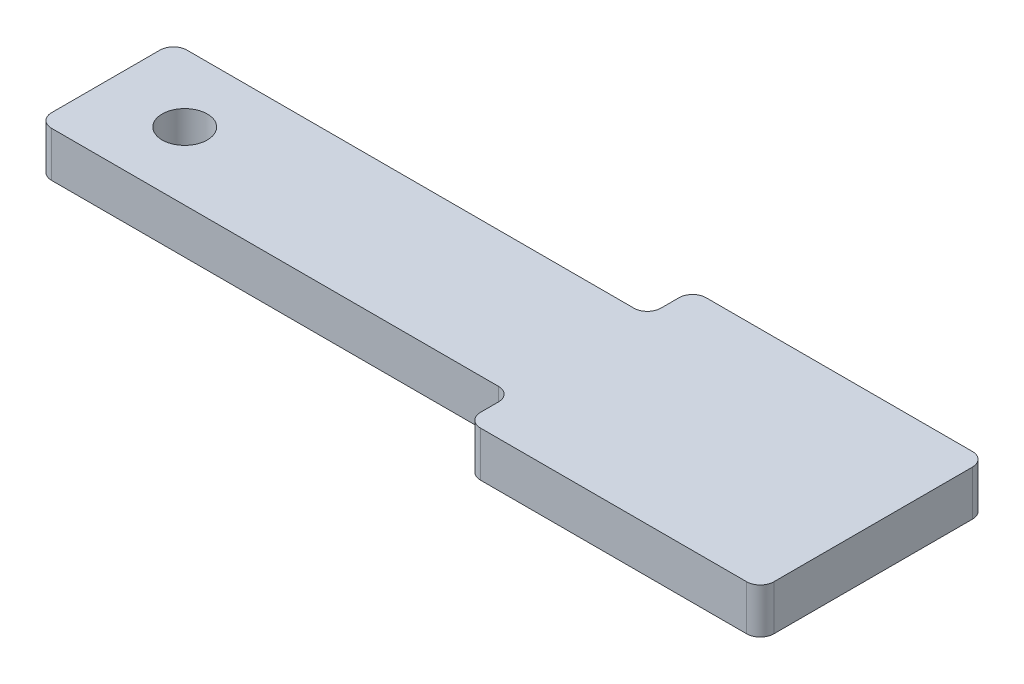
ISO-10303-21;
HEADER;
FILE_DESCRIPTION(('STEP AP214'),'2;1');
FILE_NAME('part.step','',(''),(''),'','','');
FILE_SCHEMA(('AUTOMOTIVE_DESIGN { 1 0 10303 214 1 1 1 1 }'));
ENDSEC;
DATA;
#1=APPLICATION_CONTEXT('core data for automotive mechanical design processes');
#2=APPLICATION_PROTOCOL_DEFINITION('international standard','automotive_design',2000,#1);
#3=PRODUCT_CONTEXT('',#1,'mechanical');
#4=PRODUCT('Part','Part','',(#3));
#5=PRODUCT_RELATED_PRODUCT_CATEGORY('part','',(#4));
#6=PRODUCT_DEFINITION_FORMATION('','',#4);
#7=PRODUCT_DEFINITION_CONTEXT('part definition',#1,'design');
#8=PRODUCT_DEFINITION('design','',#6,#7);
#9=PRODUCT_DEFINITION_SHAPE('','',#8);
#10=(LENGTH_UNIT() NAMED_UNIT(*) SI_UNIT(.MILLI.,.METRE.));
#11=(NAMED_UNIT(*) PLANE_ANGLE_UNIT() SI_UNIT($,.RADIAN.));
#12=(NAMED_UNIT(*) SI_UNIT($,.STERADIAN.) SOLID_ANGLE_UNIT());
#13=UNCERTAINTY_MEASURE_WITH_UNIT(LENGTH_MEASURE(1.E-05),#10,'distance_accuracy_value','');
#14=(GEOMETRIC_REPRESENTATION_CONTEXT(3) GLOBAL_UNCERTAINTY_ASSIGNED_CONTEXT((#13)) GLOBAL_UNIT_ASSIGNED_CONTEXT((#10,
#11,#12)) REPRESENTATION_CONTEXT('',''));
#15=CARTESIAN_POINT('',(0.,0.,0.));
#16=DIRECTION('',(0.,0.,1.));
#17=DIRECTION('',(1.,0.,0.));
#18=AXIS2_PLACEMENT_3D('',#15,#16,#17);
#19=CARTESIAN_POINT('',(0.,1.,0.));
#20=DIRECTION('',(0.,1.,0.));
#21=DIRECTION('',(0.,0.,1.));
#22=AXIS2_PLACEMENT_3D('',#19,#20,#21);
#23=PLANE('',#22);
#24=DIRECTION('',(-1.,0.,0.));
#25=VECTOR('',#24,1.);
#26=CARTESIAN_POINT('',(-4.5,1.,-3.));
#27=LINE('',#26,#25);
#28=CARTESIAN_POINT('',(-4.8,1.,-3.));
#29=VERTEX_POINT('',#28);
#30=CARTESIAN_POINT('',(-14.7,1.,-3.));
#31=VERTEX_POINT('',#30);
#32=EDGE_CURVE('E184',#29,#31,#27,.T.);
#33=ORIENTED_EDGE('',*,*,#32,.T.);
#34=CARTESIAN_POINT('',(-14.7,1.,-2.7));
#35=DIRECTION('',(0.,1.,0.));
#36=DIRECTION('',(0.,0.,1.));
#37=AXIS2_PLACEMENT_3D('',#34,#35,#36);
#38=CIRCLE('',#37,0.3);
#39=CARTESIAN_POINT('',(-15.,1.,-2.7));
#40=VERTEX_POINT('',#39);
#41=EDGE_CURVE('E223',#31,#40,#38,.T.);
#42=ORIENTED_EDGE('',*,*,#41,.T.);
#43=DIRECTION('',(0.,0.,1.));
#44=VECTOR('',#43,1.);
#45=CARTESIAN_POINT('',(-15.,1.,0.));
#46=LINE('',#45,#44);
#47=CARTESIAN_POINT('',(-15.,1.,-0.299999999999998));
#48=VERTEX_POINT('',#47);
#49=EDGE_CURVE('E167',#40,#48,#46,.T.);
#50=ORIENTED_EDGE('',*,*,#49,.T.);
#51=CARTESIAN_POINT('',(-14.7,1.,-0.299999999999998));
#52=DIRECTION('',(0.,1.,0.));
#53=DIRECTION('',(0.,0.,1.));
#54=AXIS2_PLACEMENT_3D('',#51,#52,#53);
#55=CIRCLE('',#54,0.3);
#56=CARTESIAN_POINT('',(-14.7,1.,0.));
#57=VERTEX_POINT('',#56);
#58=EDGE_CURVE('E214',#48,#57,#55,.T.);
#59=ORIENTED_EDGE('',*,*,#58,.T.);
#60=DIRECTION('',(1.,0.,0.));
#61=VECTOR('',#60,1.);
#62=CARTESIAN_POINT('',(-4.5,1.,0.));
#63=LINE('',#62,#61);
#64=CARTESIAN_POINT('',(-4.8,1.,0.));
#65=VERTEX_POINT('',#64);
#66=EDGE_CURVE('E274',#57,#65,#63,.T.);
#67=ORIENTED_EDGE('',*,*,#66,.T.);
#68=CARTESIAN_POINT('',(-4.8,1.,0.300000000000001));
#69=DIRECTION('',(0.,1.,0.));
#70=DIRECTION('',(0.,0.,1.));
#71=AXIS2_PLACEMENT_3D('',#68,#69,#70);
#72=CIRCLE('',#71,0.3);
#73=CARTESIAN_POINT('',(-4.5,1.,0.300000000000001));
#74=VERTEX_POINT('',#73);
#75=EDGE_CURVE('E11',#65,#74,#72,.F.);
#76=ORIENTED_EDGE('',*,*,#75,.T.);
#77=DIRECTION('',(0.,0.,1.));
#78=VECTOR('',#77,1.);
#79=CARTESIAN_POINT('',(-4.5,1.,0.));
#80=LINE('',#79,#78);
#81=CARTESIAN_POINT('',(-4.5,1.,0.700000000000001));
#82=VERTEX_POINT('',#81);
#83=EDGE_CURVE('E272',#74,#82,#80,.T.);
#84=ORIENTED_EDGE('',*,*,#83,.T.);
#85=CARTESIAN_POINT('',(-4.2,1.,0.700000000000001));
#86=DIRECTION('',(0.,1.,0.));
#87=DIRECTION('',(0.,0.,1.));
#88=AXIS2_PLACEMENT_3D('',#85,#86,#87);
#89=CIRCLE('',#88,0.3);
#90=CARTESIAN_POINT('',(-4.2,1.,1.));
#91=VERTEX_POINT('',#90);
#92=EDGE_CURVE('E216',#82,#91,#89,.T.);
#93=ORIENTED_EDGE('',*,*,#92,.T.);
#94=DIRECTION('',(1.,0.,0.));
#95=VECTOR('',#94,1.);
#96=CARTESIAN_POINT('',(-4.5,1.,1.));
#97=LINE('',#96,#95);
#98=CARTESIAN_POINT('',(1.7,1.,1.));
#99=VERTEX_POINT('',#98);
#100=EDGE_CURVE('E278',#91,#99,#97,.T.);
#101=ORIENTED_EDGE('',*,*,#100,.T.);
#102=CARTESIAN_POINT('',(1.7,1.,0.7));
#103=DIRECTION('',(0.,1.,0.));
#104=DIRECTION('',(0.,0.,1.));
#105=AXIS2_PLACEMENT_3D('',#102,#103,#104);
#106=CIRCLE('',#105,0.3);
#107=CARTESIAN_POINT('',(2.,1.,0.7));
#108=VERTEX_POINT('',#107);
#109=EDGE_CURVE('E218',#99,#108,#106,.T.);
#110=ORIENTED_EDGE('',*,*,#109,.T.);
#111=DIRECTION('',(0.,0.,-1.));
#112=VECTOR('',#111,1.);
#113=CARTESIAN_POINT('',(2.,1.,1.));
#114=LINE('',#113,#112);
#115=CARTESIAN_POINT('',(2.,1.,-3.7));
#116=VERTEX_POINT('',#115);
#117=EDGE_CURVE('E281',#108,#116,#114,.T.);
#118=ORIENTED_EDGE('',*,*,#117,.T.);
#119=CARTESIAN_POINT('',(1.7,1.,-3.7));
#120=DIRECTION('',(0.,1.,0.));
#121=DIRECTION('',(0.,0.,1.));
#122=AXIS2_PLACEMENT_3D('',#119,#120,#121);
#123=CIRCLE('',#122,0.3);
#124=CARTESIAN_POINT('',(1.7,1.,-4.));
#125=VERTEX_POINT('',#124);
#126=EDGE_CURVE('E220',#116,#125,#123,.T.);
#127=ORIENTED_EDGE('',*,*,#126,.T.);
#128=DIRECTION('',(-1.,0.,0.));
#129=VECTOR('',#128,1.);
#130=CARTESIAN_POINT('',(-4.5,1.,-4.));
#131=LINE('',#130,#129);
#132=CARTESIAN_POINT('',(-4.2,1.,-4.));
#133=VERTEX_POINT('',#132);
#134=EDGE_CURVE('E288',#125,#133,#131,.T.);
#135=ORIENTED_EDGE('',*,*,#134,.T.);
#136=CARTESIAN_POINT('',(-4.2,1.,-3.7));
#137=DIRECTION('',(0.,1.,0.));
#138=DIRECTION('',(0.,0.,1.));
#139=AXIS2_PLACEMENT_3D('',#136,#137,#138);
#140=CIRCLE('',#139,0.3);
#141=CARTESIAN_POINT('',(-4.5,1.,-3.7));
#142=VERTEX_POINT('',#141);
#143=EDGE_CURVE('E55',#133,#142,#140,.T.);
#144=ORIENTED_EDGE('',*,*,#143,.T.);
#145=DIRECTION('',(0.,0.,1.));
#146=VECTOR('',#145,1.);
#147=CARTESIAN_POINT('',(-4.5,1.,-3.));
#148=LINE('',#147,#146);
#149=CARTESIAN_POINT('',(-4.5,1.,-3.3));
#150=VERTEX_POINT('',#149);
#151=EDGE_CURVE('E289',#142,#150,#148,.T.);
#152=ORIENTED_EDGE('',*,*,#151,.T.);
#153=CARTESIAN_POINT('',(-4.8,1.,-3.3));
#154=DIRECTION('',(0.,1.,0.));
#155=DIRECTION('',(0.,0.,1.));
#156=AXIS2_PLACEMENT_3D('',#153,#154,#155);
#157=CIRCLE('',#156,0.3);
#158=EDGE_CURVE('E256',#150,#29,#157,.F.);
#159=ORIENTED_EDGE('',*,*,#158,.T.);
#160=EDGE_LOOP('',(#33,#42,#50,#59,#67,#76,#84,#93,#101,#110,#118,#127,#135,#144,#152,#159));
#161=FACE_BOUND('',#160,.T.);
#162=CARTESIAN_POINT('',(-13.25,1.,-1.5));
#163=DIRECTION('',(0.,1.,0.));
#164=DIRECTION('',(0.,0.,1.));
#165=AXIS2_PLACEMENT_3D('',#162,#163,#164);
#166=CIRCLE('',#165,0.500000000000001);
#167=CARTESIAN_POINT('',(-13.25,1.,-0.999999999999998));
#168=VERTEX_POINT('',#167);
#169=EDGE_CURVE('E175',#168,#168,#166,.T.);
#170=ORIENTED_EDGE('',*,*,#169,.F.);
#171=EDGE_LOOP('',(#170));
#172=FACE_BOUND('',#171,.T.);
#173=ADVANCED_FACE('F33',(#161,#172),#23,.T.);
#174=CARTESIAN_POINT('',(0.,0.,0.));
#175=DIRECTION('',(0.,1.,0.));
#176=DIRECTION('',(0.,0.,1.));
#177=AXIS2_PLACEMENT_3D('',#174,#175,#176);
#178=PLANE('',#177);
#179=DIRECTION('',(0.,0.,1.));
#180=VECTOR('',#179,1.);
#181=CARTESIAN_POINT('',(-15.,0.,0.));
#182=LINE('',#181,#180);
#183=CARTESIAN_POINT('',(-15.,0.,-2.7));
#184=VERTEX_POINT('',#183);
#185=CARTESIAN_POINT('',(-15.,0.,-0.299999999999998));
#186=VERTEX_POINT('',#185);
#187=EDGE_CURVE('E164',#184,#186,#182,.T.);
#188=ORIENTED_EDGE('',*,*,#187,.F.);
#189=CARTESIAN_POINT('',(-14.7,0.,-2.7));
#190=DIRECTION('',(0.,1.,0.));
#191=DIRECTION('',(0.,0.,1.));
#192=AXIS2_PLACEMENT_3D('',#189,#190,#191);
#193=CIRCLE('',#192,0.3);
#194=CARTESIAN_POINT('',(-14.7,0.,-3.));
#195=VERTEX_POINT('',#194);
#196=EDGE_CURVE('E147',#184,#195,#193,.F.);
#197=ORIENTED_EDGE('',*,*,#196,.T.);
#198=DIRECTION('',(-1.,0.,0.));
#199=VECTOR('',#198,1.);
#200=CARTESIAN_POINT('',(-4.5,0.,-3.));
#201=LINE('',#200,#199);
#202=CARTESIAN_POINT('',(-4.8,0.,-3.));
#203=VERTEX_POINT('',#202);
#204=EDGE_CURVE('E200',#203,#195,#201,.T.);
#205=ORIENTED_EDGE('',*,*,#204,.F.);
#206=CARTESIAN_POINT('',(-4.8,0.,-3.3));
#207=DIRECTION('',(0.,1.,0.));
#208=DIRECTION('',(0.,0.,1.));
#209=AXIS2_PLACEMENT_3D('',#206,#207,#208);
#210=CIRCLE('',#209,0.3);
#211=CARTESIAN_POINT('',(-4.5,0.,-3.3));
#212=VERTEX_POINT('',#211);
#213=EDGE_CURVE('E254',#203,#212,#210,.T.);
#214=ORIENTED_EDGE('',*,*,#213,.T.);
#215=DIRECTION('',(0.,0.,1.));
#216=VECTOR('',#215,1.);
#217=CARTESIAN_POINT('',(-4.5,0.,-3.));
#218=LINE('',#217,#216);
#219=CARTESIAN_POINT('',(-4.5,0.,-3.7));
#220=VERTEX_POINT('',#219);
#221=EDGE_CURVE('E198',#220,#212,#218,.T.);
#222=ORIENTED_EDGE('',*,*,#221,.F.);
#223=CARTESIAN_POINT('',(-4.2,0.,-3.7));
#224=DIRECTION('',(0.,1.,0.));
#225=DIRECTION('',(0.,0.,1.));
#226=AXIS2_PLACEMENT_3D('',#223,#224,#225);
#227=CIRCLE('',#226,0.3);
#228=CARTESIAN_POINT('',(-4.2,0.,-4.));
#229=VERTEX_POINT('',#228);
#230=EDGE_CURVE('E158',#220,#229,#227,.F.);
#231=ORIENTED_EDGE('',*,*,#230,.T.);
#232=DIRECTION('',(-1.,0.,0.));
#233=VECTOR('',#232,1.);
#234=CARTESIAN_POINT('',(-4.5,0.,-4.));
#235=LINE('',#234,#233);
#236=CARTESIAN_POINT('',(1.7,0.,-4.));
#237=VERTEX_POINT('',#236);
#238=EDGE_CURVE('E195',#237,#229,#235,.T.);
#239=ORIENTED_EDGE('',*,*,#238,.F.);
#240=CARTESIAN_POINT('',(1.7,0.,-3.7));
#241=DIRECTION('',(0.,1.,0.));
#242=DIRECTION('',(0.,0.,1.));
#243=AXIS2_PLACEMENT_3D('',#240,#241,#242);
#244=CIRCLE('',#243,0.3);
#245=CARTESIAN_POINT('',(2.,0.,-3.7));
#246=VERTEX_POINT('',#245);
#247=EDGE_CURVE('E208',#237,#246,#244,.F.);
#248=ORIENTED_EDGE('',*,*,#247,.T.);
#249=DIRECTION('',(0.,0.,-1.));
#250=VECTOR('',#249,1.);
#251=CARTESIAN_POINT('',(2.,0.,1.));
#252=LINE('',#251,#250);
#253=CARTESIAN_POINT('',(2.,0.,0.7));
#254=VERTEX_POINT('',#253);
#255=EDGE_CURVE('E192',#254,#246,#252,.T.);
#256=ORIENTED_EDGE('',*,*,#255,.F.);
#257=CARTESIAN_POINT('',(1.7,0.,0.7));
#258=DIRECTION('',(0.,1.,0.));
#259=DIRECTION('',(0.,0.,1.));
#260=AXIS2_PLACEMENT_3D('',#257,#258,#259);
#261=CIRCLE('',#260,0.3);
#262=CARTESIAN_POINT('',(1.7,0.,1.));
#263=VERTEX_POINT('',#262);
#264=EDGE_CURVE('E206',#254,#263,#261,.F.);
#265=ORIENTED_EDGE('',*,*,#264,.T.);
#266=DIRECTION('',(1.,0.,0.));
#267=VECTOR('',#266,1.);
#268=CARTESIAN_POINT('',(-4.5,0.,1.));
#269=LINE('',#268,#267);
#270=CARTESIAN_POINT('',(-4.2,0.,1.));
#271=VERTEX_POINT('',#270);
#272=EDGE_CURVE('E189',#271,#263,#269,.T.);
#273=ORIENTED_EDGE('',*,*,#272,.F.);
#274=CARTESIAN_POINT('',(-4.2,0.,0.700000000000001));
#275=DIRECTION('',(0.,1.,0.));
#276=DIRECTION('',(0.,0.,1.));
#277=AXIS2_PLACEMENT_3D('',#274,#275,#276);
#278=CIRCLE('',#277,0.3);
#279=CARTESIAN_POINT('',(-4.5,0.,0.700000000000001));
#280=VERTEX_POINT('',#279);
#281=EDGE_CURVE('E204',#271,#280,#278,.F.);
#282=ORIENTED_EDGE('',*,*,#281,.T.);
#283=DIRECTION('',(0.,0.,1.));
#284=VECTOR('',#283,1.);
#285=CARTESIAN_POINT('',(-4.5,0.,0.));
#286=LINE('',#285,#284);
#287=CARTESIAN_POINT('',(-4.5,0.,0.300000000000001));
#288=VERTEX_POINT('',#287);
#289=EDGE_CURVE('E178',#288,#280,#286,.T.);
#290=ORIENTED_EDGE('',*,*,#289,.F.);
#291=CARTESIAN_POINT('',(-4.8,0.,0.300000000000001));
#292=DIRECTION('',(0.,1.,0.));
#293=DIRECTION('',(0.,0.,1.));
#294=AXIS2_PLACEMENT_3D('',#291,#292,#293);
#295=CIRCLE('',#294,0.3);
#296=CARTESIAN_POINT('',(-4.8,0.,0.));
#297=VERTEX_POINT('',#296);
#298=EDGE_CURVE('E41',#288,#297,#295,.T.);
#299=ORIENTED_EDGE('',*,*,#298,.T.);
#300=DIRECTION('',(1.,0.,0.));
#301=VECTOR('',#300,1.);
#302=CARTESIAN_POINT('',(-4.5,0.,0.));
#303=LINE('',#302,#301);
#304=CARTESIAN_POINT('',(-14.7,0.,0.));
#305=VERTEX_POINT('',#304);
#306=EDGE_CURVE('E174',#305,#297,#303,.T.);
#307=ORIENTED_EDGE('',*,*,#306,.F.);
#308=CARTESIAN_POINT('',(-14.7,0.,-0.299999999999998));
#309=DIRECTION('',(0.,1.,0.));
#310=DIRECTION('',(0.,0.,1.));
#311=AXIS2_PLACEMENT_3D('',#308,#309,#310);
#312=CIRCLE('',#311,0.3);
#313=EDGE_CURVE('E168',#305,#186,#312,.F.);
#314=ORIENTED_EDGE('',*,*,#313,.T.);
#315=EDGE_LOOP('',(#188,#197,#205,#214,#222,#231,#239,#248,#256,#265,#273,#282,#290,#299,#307,#314));
#316=FACE_BOUND('',#315,.T.);
#317=CARTESIAN_POINT('',(-13.25,0.,-1.5));
#318=DIRECTION('',(0.,1.,0.));
#319=DIRECTION('',(0.,0.,1.));
#320=AXIS2_PLACEMENT_3D('',#317,#318,#319);
#321=CIRCLE('',#320,0.500000000000001);
#322=CARTESIAN_POINT('',(-13.25,0.,-0.999999999999998));
#323=VERTEX_POINT('',#322);
#324=EDGE_CURVE('E181',#323,#323,#321,.T.);
#325=ORIENTED_EDGE('',*,*,#324,.T.);
#326=EDGE_LOOP('',(#325));
#327=FACE_BOUND('',#326,.T.);
#328=ADVANCED_FACE('F171',(#316,#327),#178,.F.);
#329=CARTESIAN_POINT('',(-15.,1.,0.));
#330=DIRECTION('',(1.,0.,0.));
#331=DIRECTION('',(0.,0.,-1.));
#332=AXIS2_PLACEMENT_3D('',#329,#330,#331);
#333=PLANE('',#332);
#334=ORIENTED_EDGE('',*,*,#49,.F.);
#335=DIRECTION('',(0.,-1.,0.));
#336=VECTOR('',#335,1.);
#337=CARTESIAN_POINT('',(-15.,1.,-2.7));
#338=LINE('',#337,#336);
#339=EDGE_CURVE('E151',#40,#184,#338,.T.);
#340=ORIENTED_EDGE('',*,*,#339,.T.);
#341=ORIENTED_EDGE('',*,*,#187,.T.);
#342=DIRECTION('',(0.,-1.,0.));
#343=VECTOR('',#342,1.);
#344=CARTESIAN_POINT('',(-15.,1.,-0.299999999999998));
#345=LINE('',#344,#343);
#346=EDGE_CURVE('E169',#186,#48,#345,.F.);
#347=ORIENTED_EDGE('',*,*,#346,.T.);
#348=EDGE_LOOP('',(#334,#340,#341,#347));
#349=FACE_BOUND('',#348,.T.);
#350=ADVANCED_FACE('F163',(#349),#333,.F.);
#351=CARTESIAN_POINT('',(-4.5,1.,0.));
#352=DIRECTION('',(0.,0.,-1.));
#353=DIRECTION('',(-1.,0.,0.));
#354=AXIS2_PLACEMENT_3D('',#351,#352,#353);
#355=PLANE('',#354);
#356=ORIENTED_EDGE('',*,*,#306,.T.);
#357=DIRECTION('',(0.,-1.,0.));
#358=VECTOR('',#357,1.);
#359=CARTESIAN_POINT('',(-4.8,1.,0.));
#360=LINE('',#359,#358);
#361=EDGE_CURVE('E252',#297,#65,#360,.F.);
#362=ORIENTED_EDGE('',*,*,#361,.T.);
#363=ORIENTED_EDGE('',*,*,#66,.F.);
#364=DIRECTION('',(0.,-1.,0.));
#365=VECTOR('',#364,1.);
#366=CARTESIAN_POINT('',(-14.7,1.,0.));
#367=LINE('',#366,#365);
#368=EDGE_CURVE('E249',#57,#305,#367,.T.);
#369=ORIENTED_EDGE('',*,*,#368,.T.);
#370=EDGE_LOOP('',(#356,#362,#363,#369));
#371=FACE_BOUND('',#370,.T.);
#372=ADVANCED_FACE('F262',(#371),#355,.F.);
#373=CARTESIAN_POINT('',(-4.5,1.,0.));
#374=DIRECTION('',(1.,0.,0.));
#375=DIRECTION('',(0.,0.,-1.));
#376=AXIS2_PLACEMENT_3D('',#373,#374,#375);
#377=PLANE('',#376);
#378=ORIENTED_EDGE('',*,*,#289,.T.);
#379=DIRECTION('',(0.,-1.,0.));
#380=VECTOR('',#379,1.);
#381=CARTESIAN_POINT('',(-4.5,1.,0.700000000000001));
#382=LINE('',#381,#380);
#383=EDGE_CURVE('E247',#280,#82,#382,.F.);
#384=ORIENTED_EDGE('',*,*,#383,.T.);
#385=ORIENTED_EDGE('',*,*,#83,.F.);
#386=DIRECTION('',(0.,-1.,0.));
#387=VECTOR('',#386,1.);
#388=CARTESIAN_POINT('',(-4.5,0.,0.300000000000001));
#389=LINE('',#388,#387);
#390=EDGE_CURVE('E244',#74,#288,#389,.T.);
#391=ORIENTED_EDGE('',*,*,#390,.T.);
#392=EDGE_LOOP('',(#378,#384,#385,#391));
#393=FACE_BOUND('',#392,.T.);
#394=ADVANCED_FACE('F276',(#393),#377,.F.);
#395=CARTESIAN_POINT('',(-4.5,1.,1.));
#396=DIRECTION('',(0.,0.,-1.));
#397=DIRECTION('',(-1.,0.,0.));
#398=AXIS2_PLACEMENT_3D('',#395,#396,#397);
#399=PLANE('',#398);
#400=ORIENTED_EDGE('',*,*,#272,.T.);
#401=DIRECTION('',(0.,-1.,0.));
#402=VECTOR('',#401,1.);
#403=CARTESIAN_POINT('',(1.7,1.,1.));
#404=LINE('',#403,#402);
#405=EDGE_CURVE('E242',#263,#99,#404,.F.);
#406=ORIENTED_EDGE('',*,*,#405,.T.);
#407=ORIENTED_EDGE('',*,*,#100,.F.);
#408=DIRECTION('',(0.,-1.,0.));
#409=VECTOR('',#408,1.);
#410=CARTESIAN_POINT('',(-4.2,1.,1.));
#411=LINE('',#410,#409);
#412=EDGE_CURVE('E239',#91,#271,#411,.T.);
#413=ORIENTED_EDGE('',*,*,#412,.T.);
#414=EDGE_LOOP('',(#400,#406,#407,#413));
#415=FACE_BOUND('',#414,.T.);
#416=ADVANCED_FACE('F323',(#415),#399,.F.);
#417=CARTESIAN_POINT('',(2.,1.,1.));
#418=DIRECTION('',(-1.,0.,0.));
#419=DIRECTION('',(0.,0.,1.));
#420=AXIS2_PLACEMENT_3D('',#417,#418,#419);
#421=PLANE('',#420);
#422=ORIENTED_EDGE('',*,*,#255,.T.);
#423=DIRECTION('',(0.,-1.,0.));
#424=VECTOR('',#423,1.);
#425=CARTESIAN_POINT('',(2.,1.,-3.7));
#426=LINE('',#425,#424);
#427=EDGE_CURVE('E237',#246,#116,#426,.F.);
#428=ORIENTED_EDGE('',*,*,#427,.T.);
#429=ORIENTED_EDGE('',*,*,#117,.F.);
#430=DIRECTION('',(0.,-1.,0.));
#431=VECTOR('',#430,1.);
#432=CARTESIAN_POINT('',(2.,1.,0.7));
#433=LINE('',#432,#431);
#434=EDGE_CURVE('E234',#108,#254,#433,.T.);
#435=ORIENTED_EDGE('',*,*,#434,.T.);
#436=EDGE_LOOP('',(#422,#428,#429,#435));
#437=FACE_BOUND('',#436,.T.);
#438=ADVANCED_FACE('F314',(#437),#421,.F.);
#439=CARTESIAN_POINT('',(-4.5,1.,-4.));
#440=DIRECTION('',(0.,0.,1.));
#441=DIRECTION('',(1.,0.,0.));
#442=AXIS2_PLACEMENT_3D('',#439,#440,#441);
#443=PLANE('',#442);
#444=ORIENTED_EDGE('',*,*,#238,.T.);
#445=DIRECTION('',(0.,-1.,0.));
#446=VECTOR('',#445,1.);
#447=CARTESIAN_POINT('',(-4.2,1.,-4.));
#448=LINE('',#447,#446);
#449=EDGE_CURVE('E232',#229,#133,#448,.F.);
#450=ORIENTED_EDGE('',*,*,#449,.T.);
#451=ORIENTED_EDGE('',*,*,#134,.F.);
#452=DIRECTION('',(0.,-1.,0.));
#453=VECTOR('',#452,1.);
#454=CARTESIAN_POINT('',(1.7,1.,-4.));
#455=LINE('',#454,#453);
#456=EDGE_CURVE('E229',#125,#237,#455,.T.);
#457=ORIENTED_EDGE('',*,*,#456,.T.);
#458=EDGE_LOOP('',(#444,#450,#451,#457));
#459=FACE_BOUND('',#458,.T.);
#460=ADVANCED_FACE('F305',(#459),#443,.F.);
#461=CARTESIAN_POINT('',(-4.5,1.,-3.));
#462=DIRECTION('',(1.,0.,0.));
#463=DIRECTION('',(0.,0.,-1.));
#464=AXIS2_PLACEMENT_3D('',#461,#462,#463);
#465=PLANE('',#464);
#466=ORIENTED_EDGE('',*,*,#221,.T.);
#467=DIRECTION('',(0.,-1.,0.));
#468=VECTOR('',#467,1.);
#469=CARTESIAN_POINT('',(-4.5,1.,-3.3));
#470=LINE('',#469,#468);
#471=EDGE_CURVE('E48',#212,#150,#470,.F.);
#472=ORIENTED_EDGE('',*,*,#471,.T.);
#473=ORIENTED_EDGE('',*,*,#151,.F.);
#474=DIRECTION('',(0.,-1.,0.));
#475=VECTOR('',#474,1.);
#476=CARTESIAN_POINT('',(-4.5,1.,-3.7));
#477=LINE('',#476,#475);
#478=EDGE_CURVE('E225',#142,#220,#477,.T.);
#479=ORIENTED_EDGE('',*,*,#478,.T.);
#480=EDGE_LOOP('',(#466,#472,#473,#479));
#481=FACE_BOUND('',#480,.T.);
#482=ADVANCED_FACE('F298',(#481),#465,.F.);
#483=CARTESIAN_POINT('',(-4.5,1.,-3.));
#484=DIRECTION('',(0.,0.,1.));
#485=DIRECTION('',(1.,0.,0.));
#486=AXIS2_PLACEMENT_3D('',#483,#484,#485);
#487=PLANE('',#486);
#488=ORIENTED_EDGE('',*,*,#204,.T.);
#489=DIRECTION('',(0.,-1.,0.));
#490=VECTOR('',#489,1.);
#491=CARTESIAN_POINT('',(-14.7,1.,-3.));
#492=LINE('',#491,#490);
#493=EDGE_CURVE('E152',#195,#31,#492,.F.);
#494=ORIENTED_EDGE('',*,*,#493,.T.);
#495=ORIENTED_EDGE('',*,*,#32,.F.);
#496=DIRECTION('',(0.,-1.,0.));
#497=VECTOR('',#496,1.);
#498=CARTESIAN_POINT('',(-4.8,0.,-3.));
#499=LINE('',#498,#497);
#500=EDGE_CURVE('E157',#29,#203,#499,.T.);
#501=ORIENTED_EDGE('',*,*,#500,.T.);
#502=EDGE_LOOP('',(#488,#494,#495,#501));
#503=FACE_BOUND('',#502,.T.);
#504=ADVANCED_FACE('F294',(#503),#487,.F.);
#505=CARTESIAN_POINT('',(-13.25,1.,-1.5));
#506=DIRECTION('',(0.,-1.,0.));
#507=DIRECTION('',(0.,0.,-1.));
#508=AXIS2_PLACEMENT_3D('',#505,#506,#507);
#509=CYLINDRICAL_SURFACE('',#508,0.500000000000001);
#510=ORIENTED_EDGE('',*,*,#169,.T.);
#511=EDGE_LOOP('',(#510));
#512=FACE_BOUND('',#511,.T.);
#513=ORIENTED_EDGE('',*,*,#324,.F.);
#514=EDGE_LOOP('',(#513));
#515=FACE_BOUND('',#514,.T.);
#516=ADVANCED_FACE('F342',(#512,#515),#509,.F.);
#517=CARTESIAN_POINT('',(-14.7,1.,-2.7));
#518=DIRECTION('',(0.,-1.,0.));
#519=DIRECTION('',(0.,0.,-1.));
#520=AXIS2_PLACEMENT_3D('',#517,#518,#519);
#521=CYLINDRICAL_SURFACE('',#520,0.3);
#522=ORIENTED_EDGE('',*,*,#41,.F.);
#523=ORIENTED_EDGE('',*,*,#493,.F.);
#524=ORIENTED_EDGE('',*,*,#196,.F.);
#525=ORIENTED_EDGE('',*,*,#339,.F.);
#526=EDGE_LOOP('',(#522,#523,#524,#525));
#527=FACE_BOUND('',#526,.T.);
#528=ADVANCED_FACE('F150',(#527),#521,.T.);
#529=CARTESIAN_POINT('',(-4.8,1.,-3.3));
#530=DIRECTION('',(0.,1.,0.));
#531=DIRECTION('',(0.,0.,1.));
#532=AXIS2_PLACEMENT_3D('',#529,#530,#531);
#533=CYLINDRICAL_SURFACE('',#532,0.3);
#534=ORIENTED_EDGE('',*,*,#158,.F.);
#535=ORIENTED_EDGE('',*,*,#471,.F.);
#536=ORIENTED_EDGE('',*,*,#213,.F.);
#537=ORIENTED_EDGE('',*,*,#500,.F.);
#538=EDGE_LOOP('',(#534,#535,#536,#537));
#539=FACE_BOUND('',#538,.T.);
#540=ADVANCED_FACE('F296',(#539),#533,.F.);
#541=CARTESIAN_POINT('',(-4.2,1.,-3.7));
#542=DIRECTION('',(0.,-1.,0.));
#543=DIRECTION('',(0.,0.,-1.));
#544=AXIS2_PLACEMENT_3D('',#541,#542,#543);
#545=CYLINDRICAL_SURFACE('',#544,0.3);
#546=ORIENTED_EDGE('',*,*,#143,.F.);
#547=ORIENTED_EDGE('',*,*,#449,.F.);
#548=ORIENTED_EDGE('',*,*,#230,.F.);
#549=ORIENTED_EDGE('',*,*,#478,.F.);
#550=EDGE_LOOP('',(#546,#547,#548,#549));
#551=FACE_BOUND('',#550,.T.);
#552=ADVANCED_FACE('F301',(#551),#545,.T.);
#553=CARTESIAN_POINT('',(1.7,1.,-3.7));
#554=DIRECTION('',(0.,-1.,0.));
#555=DIRECTION('',(0.,0.,-1.));
#556=AXIS2_PLACEMENT_3D('',#553,#554,#555);
#557=CYLINDRICAL_SURFACE('',#556,0.3);
#558=ORIENTED_EDGE('',*,*,#126,.F.);
#559=ORIENTED_EDGE('',*,*,#427,.F.);
#560=ORIENTED_EDGE('',*,*,#247,.F.);
#561=ORIENTED_EDGE('',*,*,#456,.F.);
#562=EDGE_LOOP('',(#558,#559,#560,#561));
#563=FACE_BOUND('',#562,.T.);
#564=ADVANCED_FACE('F310',(#563),#557,.T.);
#565=CARTESIAN_POINT('',(1.7,1.,0.7));
#566=DIRECTION('',(0.,-1.,0.));
#567=DIRECTION('',(0.,0.,-1.));
#568=AXIS2_PLACEMENT_3D('',#565,#566,#567);
#569=CYLINDRICAL_SURFACE('',#568,0.3);
#570=ORIENTED_EDGE('',*,*,#109,.F.);
#571=ORIENTED_EDGE('',*,*,#405,.F.);
#572=ORIENTED_EDGE('',*,*,#264,.F.);
#573=ORIENTED_EDGE('',*,*,#434,.F.);
#574=EDGE_LOOP('',(#570,#571,#572,#573));
#575=FACE_BOUND('',#574,.T.);
#576=ADVANCED_FACE('F319',(#575),#569,.T.);
#577=CARTESIAN_POINT('',(-4.2,1.,0.700000000000001));
#578=DIRECTION('',(0.,-1.,0.));
#579=DIRECTION('',(0.,0.,-1.));
#580=AXIS2_PLACEMENT_3D('',#577,#578,#579);
#581=CYLINDRICAL_SURFACE('',#580,0.3);
#582=ORIENTED_EDGE('',*,*,#92,.F.);
#583=ORIENTED_EDGE('',*,*,#383,.F.);
#584=ORIENTED_EDGE('',*,*,#281,.F.);
#585=ORIENTED_EDGE('',*,*,#412,.F.);
#586=EDGE_LOOP('',(#582,#583,#584,#585));
#587=FACE_BOUND('',#586,.T.);
#588=ADVANCED_FACE('F327',(#587),#581,.T.);
#589=CARTESIAN_POINT('',(-4.8,1.,0.300000000000001));
#590=DIRECTION('',(0.,1.,0.));
#591=DIRECTION('',(0.,0.,1.));
#592=AXIS2_PLACEMENT_3D('',#589,#590,#591);
#593=CYLINDRICAL_SURFACE('',#592,0.3);
#594=ORIENTED_EDGE('',*,*,#75,.F.);
#595=ORIENTED_EDGE('',*,*,#361,.F.);
#596=ORIENTED_EDGE('',*,*,#298,.F.);
#597=ORIENTED_EDGE('',*,*,#390,.F.);
#598=EDGE_LOOP('',(#594,#595,#596,#597));
#599=FACE_BOUND('',#598,.T.);
#600=ADVANCED_FACE('F267',(#599),#593,.F.);
#601=CARTESIAN_POINT('',(-14.7,1.,-0.299999999999998));
#602=DIRECTION('',(0.,-1.,0.));
#603=DIRECTION('',(0.,0.,-1.));
#604=AXIS2_PLACEMENT_3D('',#601,#602,#603);
#605=CYLINDRICAL_SURFACE('',#604,0.3);
#606=ORIENTED_EDGE('',*,*,#58,.F.);
#607=ORIENTED_EDGE('',*,*,#346,.F.);
#608=ORIENTED_EDGE('',*,*,#313,.F.);
#609=ORIENTED_EDGE('',*,*,#368,.F.);
#610=EDGE_LOOP('',(#606,#607,#608,#609));
#611=FACE_BOUND('',#610,.T.);
#612=ADVANCED_FACE('F35',(#611),#605,.T.);
#613=CLOSED_SHELL('',(#173,#328,#350,#372,#394,#416,#438,#460,#482,#504,#516,#528,#540,#552,
#564,#576,#588,#600,#612));
#614=MANIFOLD_SOLID_BREP('B2',#613);
#615=ADVANCED_BREP_SHAPE_REPRESENTATION('',(#18,#614),#14);
#616=SHAPE_DEFINITION_REPRESENTATION(#9,#615);
ENDSEC;
END-ISO-10303-21;
